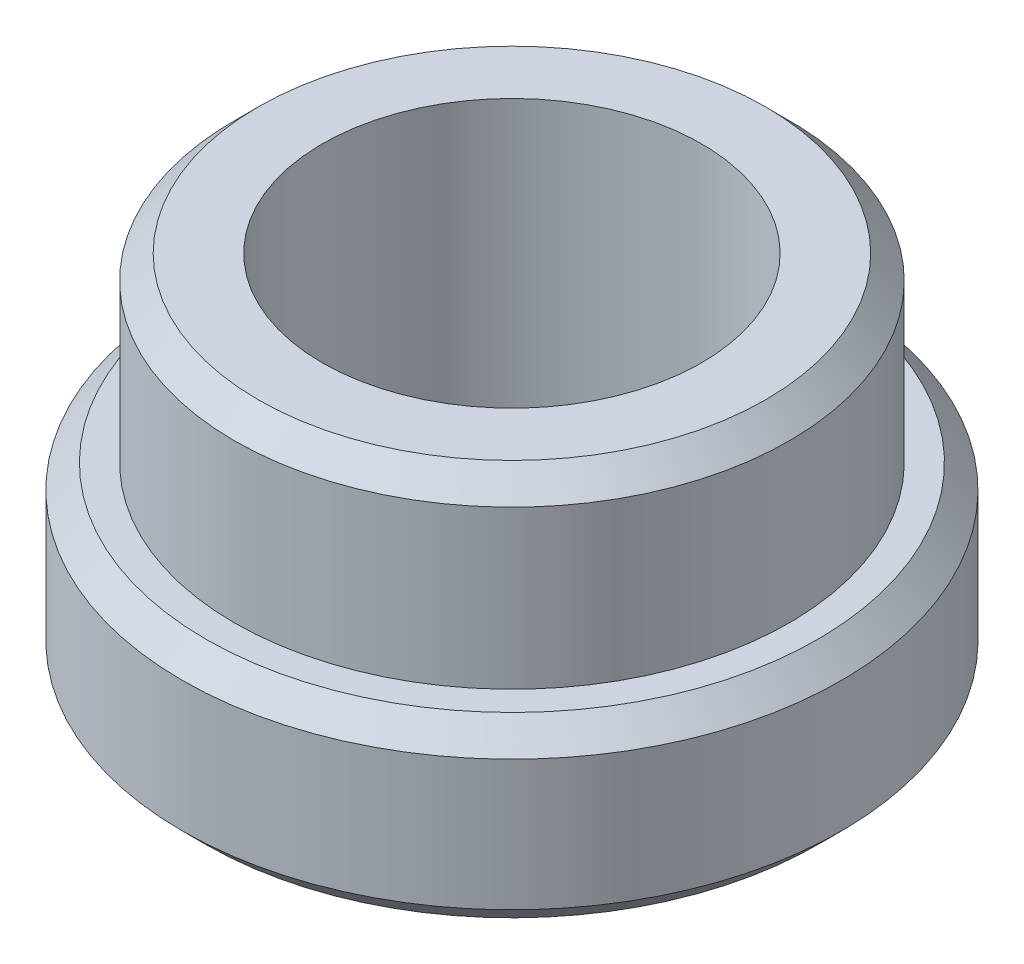
ISO-10303-21;
HEADER;
FILE_DESCRIPTION(('STEP AP214'),'2;1');
FILE_NAME('part.step','',(''),(''),'','','');
FILE_SCHEMA(('AUTOMOTIVE_DESIGN { 1 0 10303 214 1 1 1 1 }'));
ENDSEC;
DATA;
#1=APPLICATION_CONTEXT('core data for automotive mechanical design processes');
#2=APPLICATION_PROTOCOL_DEFINITION('international standard','automotive_design',2000,#1);
#3=PRODUCT_CONTEXT('',#1,'mechanical');
#4=PRODUCT('Part','Part','',(#3));
#5=PRODUCT_RELATED_PRODUCT_CATEGORY('part','',(#4));
#6=PRODUCT_DEFINITION_FORMATION('','',#4);
#7=PRODUCT_DEFINITION_CONTEXT('part definition',#1,'design');
#8=PRODUCT_DEFINITION('design','',#6,#7);
#9=PRODUCT_DEFINITION_SHAPE('','',#8);
#10=(LENGTH_UNIT() NAMED_UNIT(*) SI_UNIT(.MILLI.,.METRE.));
#11=(NAMED_UNIT(*) PLANE_ANGLE_UNIT() SI_UNIT($,.RADIAN.));
#12=(NAMED_UNIT(*) SI_UNIT($,.STERADIAN.) SOLID_ANGLE_UNIT());
#13=UNCERTAINTY_MEASURE_WITH_UNIT(LENGTH_MEASURE(1.E-05),#10,'distance_accuracy_value','');
#14=(GEOMETRIC_REPRESENTATION_CONTEXT(3) GLOBAL_UNCERTAINTY_ASSIGNED_CONTEXT((#13)) GLOBAL_UNIT_ASSIGNED_CONTEXT((#10,
#11,#12)) REPRESENTATION_CONTEXT('',''));
#15=CARTESIAN_POINT('',(0.,0.,0.));
#16=DIRECTION('',(0.,0.,1.));
#17=DIRECTION('',(1.,0.,0.));
#18=AXIS2_PLACEMENT_3D('',#15,#16,#17);
#19=CARTESIAN_POINT('',(0.,1.5,0.));
#20=DIRECTION('',(0.,-1.,0.));
#21=DIRECTION('',(0.,0.,-1.));
#22=AXIS2_PLACEMENT_3D('',#19,#20,#21);
#23=CYLINDRICAL_SURFACE('',#22,2.78);
#24=CARTESIAN_POINT('',(0.,1.3,0.));
#25=DIRECTION('',(0.,1.,0.));
#26=DIRECTION('',(0.,0.,1.));
#27=AXIS2_PLACEMENT_3D('',#24,#25,#26);
#28=CIRCLE('',#27,2.78);
#29=CARTESIAN_POINT('',(0.,1.3,2.78));
#30=VERTEX_POINT('',#29);
#31=EDGE_CURVE('E54',#30,#30,#28,.F.);
#32=ORIENTED_EDGE('',*,*,#31,.T.);
#33=EDGE_LOOP('',(#32));
#34=FACE_BOUND('',#33,.T.);
#35=CARTESIAN_POINT('',(0.,0.199999999999998,0.));
#36=DIRECTION('',(0.,1.,0.));
#37=DIRECTION('',(0.,0.,1.));
#38=AXIS2_PLACEMENT_3D('',#35,#36,#37);
#39=CIRCLE('',#38,2.78);
#40=CARTESIAN_POINT('',(0.,0.199999999999998,2.78));
#41=VERTEX_POINT('',#40);
#42=EDGE_CURVE('E57',#41,#41,#39,.T.);
#43=ORIENTED_EDGE('',*,*,#42,.T.);
#44=EDGE_LOOP('',(#43));
#45=FACE_BOUND('',#44,.T.);
#46=ADVANCED_FACE('F34',(#34,#45),#23,.T.);
#47=CARTESIAN_POINT('',(0.,1.5,0.));
#48=DIRECTION('',(0.,1.,0.));
#49=DIRECTION('',(0.,0.,1.));
#50=AXIS2_PLACEMENT_3D('',#47,#48,#49);
#51=PLANE('',#50);
#52=CARTESIAN_POINT('',(0.,1.5,0.));
#53=DIRECTION('',(0.,1.,0.));
#54=DIRECTION('',(0.,0.,1.));
#55=AXIS2_PLACEMENT_3D('',#52,#53,#54);
#56=CIRCLE('',#55,2.34);
#57=CARTESIAN_POINT('',(0.,1.5,2.34));
#58=VERTEX_POINT('',#57);
#59=EDGE_CURVE('E45',#58,#58,#56,.T.);
#60=ORIENTED_EDGE('',*,*,#59,.F.);
#61=EDGE_LOOP('',(#60));
#62=FACE_BOUND('',#61,.T.);
#63=CARTESIAN_POINT('',(0.,1.5,0.));
#64=DIRECTION('',(0.,1.,0.));
#65=DIRECTION('',(0.,0.,1.));
#66=AXIS2_PLACEMENT_3D('',#63,#64,#65);
#67=CIRCLE('',#66,2.58);
#68=CARTESIAN_POINT('',(0.,1.5,2.58));
#69=VERTEX_POINT('',#68);
#70=EDGE_CURVE('E60',#69,#69,#67,.T.);
#71=ORIENTED_EDGE('',*,*,#70,.T.);
#72=EDGE_LOOP('',(#71));
#73=FACE_BOUND('',#72,.T.);
#74=ADVANCED_FACE('F91',(#62,#73),#51,.T.);
#75=CARTESIAN_POINT('',(0.,0.,0.));
#76=DIRECTION('',(0.,1.,0.));
#77=DIRECTION('',(0.,0.,1.));
#78=AXIS2_PLACEMENT_3D('',#75,#76,#77);
#79=PLANE('',#78);
#80=CARTESIAN_POINT('',(0.,0.,0.));
#81=DIRECTION('',(0.,1.,0.));
#82=DIRECTION('',(0.,0.,1.));
#83=AXIS2_PLACEMENT_3D('',#80,#81,#82);
#84=CIRCLE('',#83,1.6);
#85=CARTESIAN_POINT('',(0.,0.,1.6));
#86=VERTEX_POINT('',#85);
#87=EDGE_CURVE('E62',#86,#86,#84,.T.);
#88=ORIENTED_EDGE('',*,*,#87,.T.);
#89=EDGE_LOOP('',(#88));
#90=FACE_BOUND('',#89,.T.);
#91=CARTESIAN_POINT('',(0.,0.,0.));
#92=DIRECTION('',(0.,1.,0.));
#93=DIRECTION('',(0.,0.,1.));
#94=AXIS2_PLACEMENT_3D('',#91,#92,#93);
#95=CIRCLE('',#94,2.58);
#96=CARTESIAN_POINT('',(0.,0.,2.58));
#97=VERTEX_POINT('',#96);
#98=EDGE_CURVE('E49',#97,#97,#95,.F.);
#99=ORIENTED_EDGE('',*,*,#98,.T.);
#100=EDGE_LOOP('',(#99));
#101=FACE_BOUND('',#100,.T.);
#102=ADVANCED_FACE('F70',(#90,#101),#79,.F.);
#103=CARTESIAN_POINT('',(0.,1.5,0.));
#104=DIRECTION('',(0.,-1.,0.));
#105=DIRECTION('',(0.,0.,-1.));
#106=AXIS2_PLACEMENT_3D('',#103,#104,#105);
#107=CONICAL_SURFACE('',#106,2.58,0.785398163397445);
#108=ORIENTED_EDGE('',*,*,#31,.F.);
#109=EDGE_LOOP('',(#108));
#110=FACE_BOUND('',#109,.T.);
#111=ORIENTED_EDGE('',*,*,#70,.F.);
#112=EDGE_LOOP('',(#111));
#113=FACE_BOUND('',#112,.T.);
#114=ADVANCED_FACE('F102',(#110,#113),#107,.T.);
#115=CARTESIAN_POINT('',(0.,0.199999999999998,0.));
#116=DIRECTION('',(0.,1.,0.));
#117=DIRECTION('',(0.,0.,1.));
#118=AXIS2_PLACEMENT_3D('',#115,#116,#117);
#119=CONICAL_SURFACE('',#118,2.78,0.785398163397451);
#120=ORIENTED_EDGE('',*,*,#98,.F.);
#121=EDGE_LOOP('',(#120));
#122=FACE_BOUND('',#121,.T.);
#123=ORIENTED_EDGE('',*,*,#42,.F.);
#124=EDGE_LOOP('',(#123));
#125=FACE_BOUND('',#124,.T.);
#126=ADVANCED_FACE('F88',(#122,#125),#119,.T.);
#127=CARTESIAN_POINT('',(0.,3.03,0.));
#128=DIRECTION('',(0.,-1.,0.));
#129=DIRECTION('',(0.,0.,-1.));
#130=AXIS2_PLACEMENT_3D('',#127,#128,#129);
#131=CYLINDRICAL_SURFACE('',#130,2.34);
#132=CARTESIAN_POINT('',(0.,2.83,0.));
#133=DIRECTION('',(0.,1.,0.));
#134=DIRECTION('',(0.,0.,1.));
#135=AXIS2_PLACEMENT_3D('',#132,#133,#134);
#136=CIRCLE('',#135,2.34);
#137=CARTESIAN_POINT('',(0.,2.83,2.34));
#138=VERTEX_POINT('',#137);
#139=EDGE_CURVE('E10',#138,#138,#136,.F.);
#140=ORIENTED_EDGE('',*,*,#139,.T.);
#141=EDGE_LOOP('',(#140));
#142=FACE_BOUND('',#141,.T.);
#143=ORIENTED_EDGE('',*,*,#59,.T.);
#144=EDGE_LOOP('',(#143));
#145=FACE_BOUND('',#144,.T.);
#146=ADVANCED_FACE('F81',(#142,#145),#131,.T.);
#147=CARTESIAN_POINT('',(0.,3.03,0.));
#148=DIRECTION('',(0.,1.,0.));
#149=DIRECTION('',(0.,0.,1.));
#150=AXIS2_PLACEMENT_3D('',#147,#148,#149);
#151=PLANE('',#150);
#152=CARTESIAN_POINT('',(0.,3.03,0.));
#153=DIRECTION('',(0.,1.,0.));
#154=DIRECTION('',(0.,0.,1.));
#155=AXIS2_PLACEMENT_3D('',#152,#153,#154);
#156=CIRCLE('',#155,1.6);
#157=CARTESIAN_POINT('',(0.,3.03,1.6));
#158=VERTEX_POINT('',#157);
#159=EDGE_CURVE('E64',#158,#158,#156,.T.);
#160=ORIENTED_EDGE('',*,*,#159,.F.);
#161=EDGE_LOOP('',(#160));
#162=FACE_BOUND('',#161,.T.);
#163=CARTESIAN_POINT('',(0.,3.03,0.));
#164=DIRECTION('',(0.,1.,0.));
#165=DIRECTION('',(0.,0.,1.));
#166=AXIS2_PLACEMENT_3D('',#163,#164,#165);
#167=CIRCLE('',#166,2.14);
#168=CARTESIAN_POINT('',(0.,3.03,2.14));
#169=VERTEX_POINT('',#168);
#170=EDGE_CURVE('E41',#169,#169,#167,.T.);
#171=ORIENTED_EDGE('',*,*,#170,.T.);
#172=EDGE_LOOP('',(#171));
#173=FACE_BOUND('',#172,.T.);
#174=ADVANCED_FACE('F79',(#162,#173),#151,.T.);
#175=CARTESIAN_POINT('',(0.,3.03,0.));
#176=DIRECTION('',(0.,-1.,0.));
#177=DIRECTION('',(0.,0.,-1.));
#178=AXIS2_PLACEMENT_3D('',#175,#176,#177);
#179=CONICAL_SURFACE('',#178,2.14,0.785398163397448);
#180=ORIENTED_EDGE('',*,*,#139,.F.);
#181=EDGE_LOOP('',(#180));
#182=FACE_BOUND('',#181,.T.);
#183=ORIENTED_EDGE('',*,*,#170,.F.);
#184=EDGE_LOOP('',(#183));
#185=FACE_BOUND('',#184,.T.);
#186=ADVANCED_FACE('F36',(#182,#185),#179,.T.);
#187=CARTESIAN_POINT('',(0.,0.,0.));
#188=DIRECTION('',(0.,1.,0.));
#189=DIRECTION('',(0.,0.,1.));
#190=AXIS2_PLACEMENT_3D('',#187,#188,#189);
#191=CYLINDRICAL_SURFACE('',#190,1.6);
#192=ORIENTED_EDGE('',*,*,#87,.F.);
#193=EDGE_LOOP('',(#192));
#194=FACE_BOUND('',#193,.T.);
#195=ORIENTED_EDGE('',*,*,#159,.T.);
#196=EDGE_LOOP('',(#195));
#197=FACE_BOUND('',#196,.T.);
#198=ADVANCED_FACE('F73',(#194,#197),#191,.F.);
#199=CLOSED_SHELL('',(#46,#74,#102,#114,#126,#146,#174,#186,#198));
#200=MANIFOLD_SOLID_BREP('B2',#199);
#201=ADVANCED_BREP_SHAPE_REPRESENTATION('',(#18,#200),#14);
#202=SHAPE_DEFINITION_REPRESENTATION(#9,#201);
ENDSEC;
END-ISO-10303-21;
